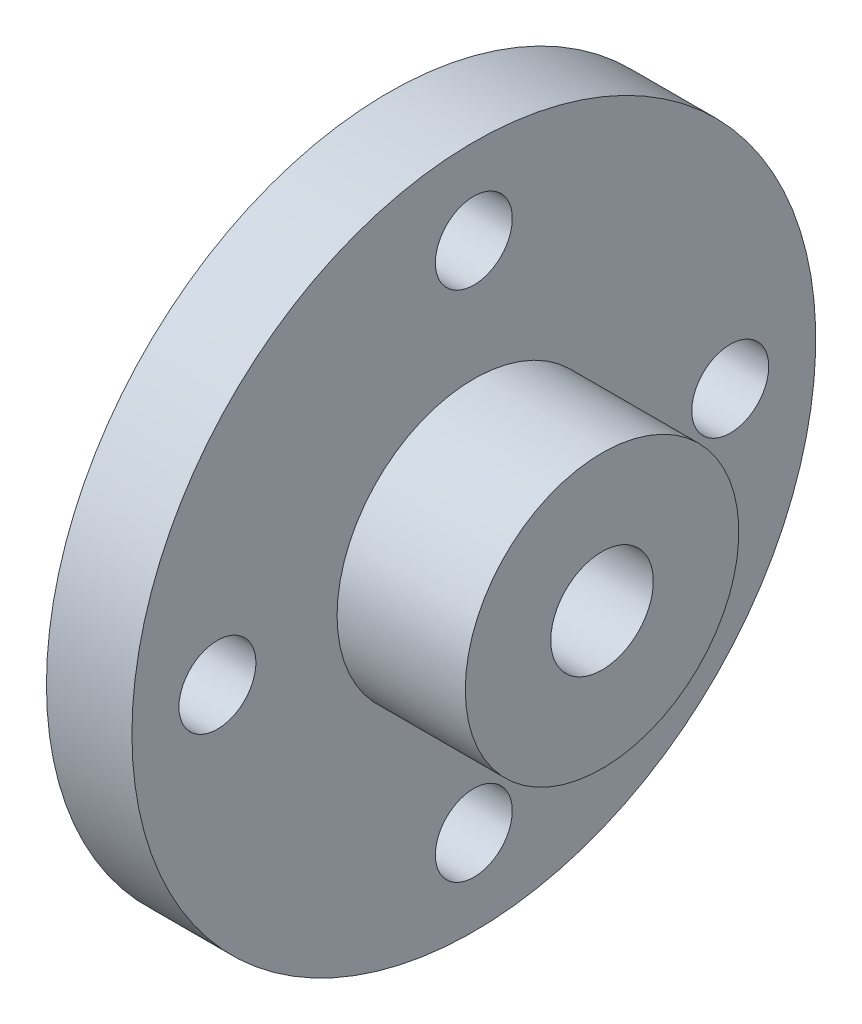
ISO-10303-21;
HEADER;
FILE_DESCRIPTION(('STEP AP214'),'2;1');
FILE_NAME('part.step','',(''),(''),'','','');
FILE_SCHEMA(('AUTOMOTIVE_DESIGN { 1 0 10303 214 1 1 1 1 }'));
ENDSEC;
DATA;
#1=APPLICATION_CONTEXT('core data for automotive mechanical design processes');
#2=APPLICATION_PROTOCOL_DEFINITION('international standard','automotive_design',2000,#1);
#3=PRODUCT_CONTEXT('',#1,'mechanical');
#4=PRODUCT('Part','Part','',(#3));
#5=PRODUCT_RELATED_PRODUCT_CATEGORY('part','',(#4));
#6=PRODUCT_DEFINITION_FORMATION('','',#4);
#7=PRODUCT_DEFINITION_CONTEXT('part definition',#1,'design');
#8=PRODUCT_DEFINITION('design','',#6,#7);
#9=PRODUCT_DEFINITION_SHAPE('','',#8);
#10=(LENGTH_UNIT() NAMED_UNIT(*) SI_UNIT(.MILLI.,.METRE.));
#11=(NAMED_UNIT(*) PLANE_ANGLE_UNIT() SI_UNIT($,.RADIAN.));
#12=(NAMED_UNIT(*) SI_UNIT($,.STERADIAN.) SOLID_ANGLE_UNIT());
#13=UNCERTAINTY_MEASURE_WITH_UNIT(LENGTH_MEASURE(1.E-05),#10,'distance_accuracy_value','');
#14=(GEOMETRIC_REPRESENTATION_CONTEXT(3) GLOBAL_UNCERTAINTY_ASSIGNED_CONTEXT((#13)) GLOBAL_UNIT_ASSIGNED_CONTEXT((#10,
#11,#12)) REPRESENTATION_CONTEXT('',''));
#15=CARTESIAN_POINT('',(0.,0.,0.));
#16=DIRECTION('',(0.,0.,1.));
#17=DIRECTION('',(1.,0.,0.));
#18=AXIS2_PLACEMENT_3D('',#15,#16,#17);
#19=CARTESIAN_POINT('',(-16.9594650205762,0.,0.));
#20=DIRECTION('',(-1.,0.,0.));
#21=DIRECTION('',(0.,0.,1.));
#22=AXIS2_PLACEMENT_3D('',#19,#20,#21);
#23=CYLINDRICAL_SURFACE('',#22,16.);
#24=CARTESIAN_POINT('',(0.,0.,0.));
#25=DIRECTION('',(-1.,0.,0.));
#26=DIRECTION('',(0.,0.,1.));
#27=AXIS2_PLACEMENT_3D('',#24,#25,#26);
#28=CIRCLE('',#27,16.);
#29=CARTESIAN_POINT('',(0.,0.,16.));
#30=VERTEX_POINT('',#29);
#31=EDGE_CURVE('E25',#30,#30,#28,.F.);
#32=ORIENTED_EDGE('',*,*,#31,.T.);
#33=EDGE_LOOP('',(#32));
#34=FACE_BOUND('',#33,.T.);
#35=CARTESIAN_POINT('',(14.9999999999999,0.,0.));
#36=DIRECTION('',(-1.,0.,0.));
#37=DIRECTION('',(0.,0.,1.));
#38=AXIS2_PLACEMENT_3D('',#35,#36,#37);
#39=CIRCLE('',#38,16.);
#40=CARTESIAN_POINT('',(14.9999999999999,0.,16.));
#41=VERTEX_POINT('',#40);
#42=EDGE_CURVE('E65',#41,#41,#39,.T.);
#43=ORIENTED_EDGE('',*,*,#42,.T.);
#44=EDGE_LOOP('',(#43));
#45=FACE_BOUND('',#44,.T.);
#46=ADVANCED_FACE('F22',(#34,#45),#23,.T.);
#47=CARTESIAN_POINT('',(0.,39.9999999999999,0.));
#48=DIRECTION('',(-1.,0.,0.));
#49=DIRECTION('',(0.,0.,1.));
#50=AXIS2_PLACEMENT_3D('',#47,#48,#49);
#51=PLANE('',#50);
#52=CARTESIAN_POINT('',(0.,3.14233320495882E-13,-30.));
#53=DIRECTION('',(-1.,0.,0.));
#54=DIRECTION('',(0.,0.,1.));
#55=AXIS2_PLACEMENT_3D('',#52,#53,#54);
#56=CIRCLE('',#55,4.5);
#57=CARTESIAN_POINT('',(0.,3.14233320495882E-13,-25.5));
#58=VERTEX_POINT('',#57);
#59=EDGE_CURVE('E63',#58,#58,#56,.T.);
#60=ORIENTED_EDGE('',*,*,#59,.T.);
#61=EDGE_LOOP('',(#60));
#62=FACE_BOUND('',#61,.T.);
#63=CARTESIAN_POINT('',(0.,-1.04744440165294E-13,30.));
#64=DIRECTION('',(-1.,0.,0.));
#65=DIRECTION('',(0.,0.,1.));
#66=AXIS2_PLACEMENT_3D('',#63,#64,#65);
#67=CIRCLE('',#66,4.5);
#68=CARTESIAN_POINT('',(0.,-1.04744440165294E-13,34.5));
#69=VERTEX_POINT('',#68);
#70=EDGE_CURVE('E60',#69,#69,#67,.T.);
#71=ORIENTED_EDGE('',*,*,#70,.T.);
#72=EDGE_LOOP('',(#71));
#73=FACE_BOUND('',#72,.T.);
#74=ORIENTED_EDGE('',*,*,#31,.F.);
#75=EDGE_LOOP('',(#74));
#76=FACE_BOUND('',#75,.T.);
#77=CARTESIAN_POINT('',(0.,0.,0.));
#78=DIRECTION('',(-1.,0.,0.));
#79=DIRECTION('',(0.,0.,1.));
#80=AXIS2_PLACEMENT_3D('',#77,#78,#79);
#81=CIRCLE('',#80,40.);
#82=CARTESIAN_POINT('',(0.,0.,40.));
#83=VERTEX_POINT('',#82);
#84=EDGE_CURVE('E57',#83,#83,#81,.T.);
#85=ORIENTED_EDGE('',*,*,#84,.F.);
#86=EDGE_LOOP('',(#85));
#87=FACE_BOUND('',#86,.T.);
#88=CARTESIAN_POINT('',(0.,30.,0.));
#89=DIRECTION('',(-1.,0.,0.));
#90=DIRECTION('',(0.,0.,1.));
#91=AXIS2_PLACEMENT_3D('',#88,#89,#90);
#92=CIRCLE('',#91,4.5);
#93=CARTESIAN_POINT('',(0.,30.,4.5));
#94=VERTEX_POINT('',#93);
#95=EDGE_CURVE('E54',#94,#94,#92,.T.);
#96=ORIENTED_EDGE('',*,*,#95,.T.);
#97=EDGE_LOOP('',(#96));
#98=FACE_BOUND('',#97,.T.);
#99=CARTESIAN_POINT('',(0.,-30.,-2.09488880330588E-13));
#100=DIRECTION('',(-1.,0.,0.));
#101=DIRECTION('',(0.,0.,1.));
#102=AXIS2_PLACEMENT_3D('',#99,#100,#101);
#103=CIRCLE('',#102,4.5);
#104=CARTESIAN_POINT('',(0.,-30.,4.49999999999979));
#105=VERTEX_POINT('',#104);
#106=EDGE_CURVE('E51',#105,#105,#103,.T.);
#107=ORIENTED_EDGE('',*,*,#106,.T.);
#108=EDGE_LOOP('',(#107));
#109=FACE_BOUND('',#108,.T.);
#110=ADVANCED_FACE('F73',(#62,#73,#76,#87,#98,#109),#51,.F.);
#111=CARTESIAN_POINT('',(14.9999999999999,16.,0.));
#112=DIRECTION('',(-1.,0.,0.));
#113=DIRECTION('',(0.,0.,1.));
#114=AXIS2_PLACEMENT_3D('',#111,#112,#113);
#115=PLANE('',#114);
#116=CARTESIAN_POINT('',(14.9999999999999,0.,0.));
#117=DIRECTION('',(-1.,0.,0.));
#118=DIRECTION('',(0.,0.,1.));
#119=AXIS2_PLACEMENT_3D('',#116,#117,#118);
#120=CIRCLE('',#119,6.);
#121=CARTESIAN_POINT('',(14.9999999999999,0.,6.));
#122=VERTEX_POINT('',#121);
#123=EDGE_CURVE('E48',#122,#122,#120,.T.);
#124=ORIENTED_EDGE('',*,*,#123,.T.);
#125=EDGE_LOOP('',(#124));
#126=FACE_BOUND('',#125,.T.);
#127=ORIENTED_EDGE('',*,*,#42,.F.);
#128=EDGE_LOOP('',(#127));
#129=FACE_BOUND('',#128,.T.);
#130=ADVANCED_FACE('F76',(#126,#129),#115,.F.);
#131=CARTESIAN_POINT('',(14.9999999999999,3.14233320495882E-13,-30.));
#132=DIRECTION('',(-1.,0.,0.));
#133=DIRECTION('',(0.,0.,1.));
#134=AXIS2_PLACEMENT_3D('',#131,#132,#133);
#135=CYLINDRICAL_SURFACE('',#134,4.5);
#136=CARTESIAN_POINT('',(-10.,3.14233320495882E-13,-30.));
#137=DIRECTION('',(-1.,0.,0.));
#138=DIRECTION('',(0.,0.,1.));
#139=AXIS2_PLACEMENT_3D('',#136,#137,#138);
#140=CIRCLE('',#139,4.5);
#141=CARTESIAN_POINT('',(-10.,3.14233320495882E-13,-25.5));
#142=VERTEX_POINT('',#141);
#143=EDGE_CURVE('E45',#142,#142,#140,.T.);
#144=ORIENTED_EDGE('',*,*,#143,.T.);
#145=EDGE_LOOP('',(#144));
#146=FACE_BOUND('',#145,.T.);
#147=ORIENTED_EDGE('',*,*,#59,.F.);
#148=EDGE_LOOP('',(#147));
#149=FACE_BOUND('',#148,.T.);
#150=ADVANCED_FACE('F119',(#146,#149),#135,.F.);
#151=CARTESIAN_POINT('',(14.9999999999999,-1.04744440165294E-13,30.));
#152=DIRECTION('',(-1.,0.,0.));
#153=DIRECTION('',(0.,0.,1.));
#154=AXIS2_PLACEMENT_3D('',#151,#152,#153);
#155=CYLINDRICAL_SURFACE('',#154,4.5);
#156=CARTESIAN_POINT('',(-10.,-1.04744440165294E-13,30.));
#157=DIRECTION('',(-1.,0.,0.));
#158=DIRECTION('',(0.,0.,1.));
#159=AXIS2_PLACEMENT_3D('',#156,#157,#158);
#160=CIRCLE('',#159,4.5);
#161=CARTESIAN_POINT('',(-10.,-1.04744440165294E-13,34.5));
#162=VERTEX_POINT('',#161);
#163=EDGE_CURVE('E42',#162,#162,#160,.T.);
#164=ORIENTED_EDGE('',*,*,#163,.T.);
#165=EDGE_LOOP('',(#164));
#166=FACE_BOUND('',#165,.T.);
#167=ORIENTED_EDGE('',*,*,#70,.F.);
#168=EDGE_LOOP('',(#167));
#169=FACE_BOUND('',#168,.T.);
#170=ADVANCED_FACE('F122',(#166,#169),#155,.F.);
#171=CARTESIAN_POINT('',(-16.9594650205762,0.,0.));
#172=DIRECTION('',(-1.,0.,0.));
#173=DIRECTION('',(0.,0.,1.));
#174=AXIS2_PLACEMENT_3D('',#171,#172,#173);
#175=CYLINDRICAL_SURFACE('',#174,40.);
#176=CARTESIAN_POINT('',(-10.,0.,0.));
#177=DIRECTION('',(-1.,0.,0.));
#178=DIRECTION('',(0.,0.,1.));
#179=AXIS2_PLACEMENT_3D('',#176,#177,#178);
#180=CIRCLE('',#179,40.);
#181=CARTESIAN_POINT('',(-10.,0.,40.));
#182=VERTEX_POINT('',#181);
#183=EDGE_CURVE('E39',#182,#182,#180,.F.);
#184=ORIENTED_EDGE('',*,*,#183,.T.);
#185=EDGE_LOOP('',(#184));
#186=FACE_BOUND('',#185,.T.);
#187=ORIENTED_EDGE('',*,*,#84,.T.);
#188=EDGE_LOOP('',(#187));
#189=FACE_BOUND('',#188,.T.);
#190=ADVANCED_FACE('F99',(#186,#189),#175,.T.);
#191=CARTESIAN_POINT('',(14.9999999999999,30.,0.));
#192=DIRECTION('',(-1.,0.,0.));
#193=DIRECTION('',(0.,0.,1.));
#194=AXIS2_PLACEMENT_3D('',#191,#192,#193);
#195=CYLINDRICAL_SURFACE('',#194,4.5);
#196=CARTESIAN_POINT('',(-10.,29.9999999999999,0.));
#197=DIRECTION('',(-1.,0.,0.));
#198=DIRECTION('',(0.,0.,1.));
#199=AXIS2_PLACEMENT_3D('',#196,#197,#198);
#200=CIRCLE('',#199,4.5);
#201=CARTESIAN_POINT('',(-10.,29.9999999999999,4.5));
#202=VERTEX_POINT('',#201);
#203=EDGE_CURVE('E34',#202,#202,#200,.T.);
#204=ORIENTED_EDGE('',*,*,#203,.T.);
#205=EDGE_LOOP('',(#204));
#206=FACE_BOUND('',#205,.T.);
#207=ORIENTED_EDGE('',*,*,#95,.F.);
#208=EDGE_LOOP('',(#207));
#209=FACE_BOUND('',#208,.T.);
#210=ADVANCED_FACE('F87',(#206,#209),#195,.F.);
#211=CARTESIAN_POINT('',(14.9999999999999,-30.,-2.09488880330588E-13));
#212=DIRECTION('',(-1.,0.,0.));
#213=DIRECTION('',(0.,0.,1.));
#214=AXIS2_PLACEMENT_3D('',#211,#212,#213);
#215=CYLINDRICAL_SURFACE('',#214,4.5);
#216=CARTESIAN_POINT('',(-10.,-30.,-2.09488880330588E-13));
#217=DIRECTION('',(-1.,0.,0.));
#218=DIRECTION('',(0.,0.,1.));
#219=AXIS2_PLACEMENT_3D('',#216,#217,#218);
#220=CIRCLE('',#219,4.5);
#221=CARTESIAN_POINT('',(-10.,-30.,4.49999999999979));
#222=VERTEX_POINT('',#221);
#223=EDGE_CURVE('E29',#222,#222,#220,.T.);
#224=ORIENTED_EDGE('',*,*,#223,.T.);
#225=EDGE_LOOP('',(#224));
#226=FACE_BOUND('',#225,.T.);
#227=ORIENTED_EDGE('',*,*,#106,.F.);
#228=EDGE_LOOP('',(#227));
#229=FACE_BOUND('',#228,.T.);
#230=ADVANCED_FACE('F84',(#226,#229),#215,.F.);
#231=CARTESIAN_POINT('',(-9.48503389009914,0.,0.));
#232=DIRECTION('',(-1.,0.,0.));
#233=DIRECTION('',(0.,0.,1.));
#234=AXIS2_PLACEMENT_3D('',#231,#232,#233);
#235=CYLINDRICAL_SURFACE('',#234,6.);
#236=ORIENTED_EDGE('',*,*,#123,.F.);
#237=EDGE_LOOP('',(#236));
#238=FACE_BOUND('',#237,.T.);
#239=CARTESIAN_POINT('',(-10.,0.,0.));
#240=DIRECTION('',(-1.,0.,0.));
#241=DIRECTION('',(0.,0.,1.));
#242=AXIS2_PLACEMENT_3D('',#239,#240,#241);
#243=CIRCLE('',#242,6.);
#244=CARTESIAN_POINT('',(-10.,0.,6.));
#245=VERTEX_POINT('',#244);
#246=EDGE_CURVE('E12',#245,#245,#243,.T.);
#247=ORIENTED_EDGE('',*,*,#246,.T.);
#248=EDGE_LOOP('',(#247));
#249=FACE_BOUND('',#248,.T.);
#250=ADVANCED_FACE('F86',(#238,#249),#235,.F.);
#251=CARTESIAN_POINT('',(-10.,0.,0.));
#252=DIRECTION('',(1.,0.,0.));
#253=DIRECTION('',(0.,0.,-1.));
#254=AXIS2_PLACEMENT_3D('',#251,#252,#253);
#255=PLANE('',#254);
#256=ORIENTED_EDGE('',*,*,#246,.F.);
#257=EDGE_LOOP('',(#256));
#258=FACE_BOUND('',#257,.T.);
#259=ORIENTED_EDGE('',*,*,#223,.F.);
#260=EDGE_LOOP('',(#259));
#261=FACE_BOUND('',#260,.T.);
#262=ORIENTED_EDGE('',*,*,#203,.F.);
#263=EDGE_LOOP('',(#262));
#264=FACE_BOUND('',#263,.T.);
#265=ORIENTED_EDGE('',*,*,#183,.F.);
#266=EDGE_LOOP('',(#265));
#267=FACE_BOUND('',#266,.T.);
#268=ORIENTED_EDGE('',*,*,#163,.F.);
#269=EDGE_LOOP('',(#268));
#270=FACE_BOUND('',#269,.T.);
#271=ORIENTED_EDGE('',*,*,#143,.F.);
#272=EDGE_LOOP('',(#271));
#273=FACE_BOUND('',#272,.T.);
#274=ADVANCED_FACE('F96',(#258,#261,#264,#267,#270,#273),#255,.F.);
#275=CLOSED_SHELL('',(#46,#110,#130,#150,#170,#190,#210,#230,#250,#274));
#276=MANIFOLD_SOLID_BREP('B1',#275);
#277=ADVANCED_BREP_SHAPE_REPRESENTATION('',(#18,#276),#14);
#278=SHAPE_DEFINITION_REPRESENTATION(#9,#277);
ENDSEC;
END-ISO-10303-21;
